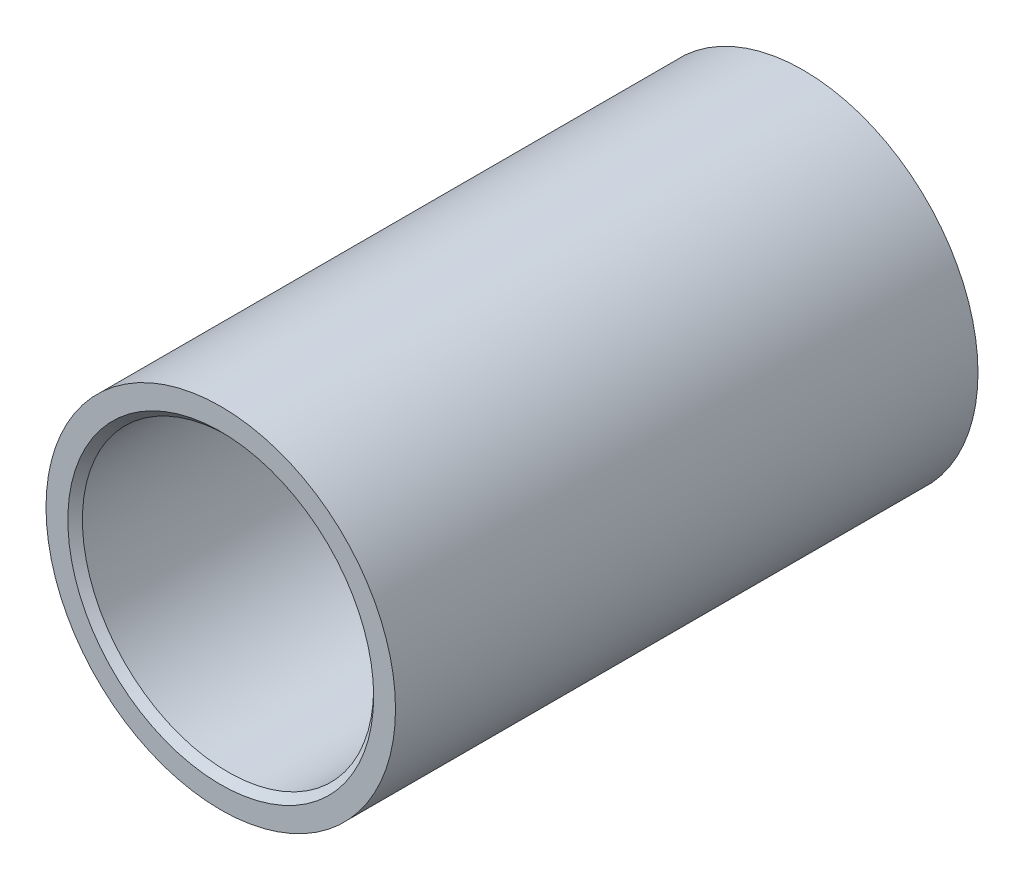
ISO-10303-21;
HEADER;
FILE_DESCRIPTION(('STEP AP214'),'2;1');
FILE_NAME('part.step','',(''),(''),'','','');
FILE_SCHEMA(('AUTOMOTIVE_DESIGN { 1 0 10303 214 1 1 1 1 }'));
ENDSEC;
DATA;
#1=APPLICATION_CONTEXT('core data for automotive mechanical design processes');
#2=APPLICATION_PROTOCOL_DEFINITION('international standard','automotive_design',2000,#1);
#3=PRODUCT_CONTEXT('',#1,'mechanical');
#4=PRODUCT('Part','Part','',(#3));
#5=PRODUCT_RELATED_PRODUCT_CATEGORY('part','',(#4));
#6=PRODUCT_DEFINITION_FORMATION('','',#4);
#7=PRODUCT_DEFINITION_CONTEXT('part definition',#1,'design');
#8=PRODUCT_DEFINITION('design','',#6,#7);
#9=PRODUCT_DEFINITION_SHAPE('','',#8);
#10=(LENGTH_UNIT() NAMED_UNIT(*) SI_UNIT(.MILLI.,.METRE.));
#11=(NAMED_UNIT(*) PLANE_ANGLE_UNIT() SI_UNIT($,.RADIAN.));
#12=(NAMED_UNIT(*) SI_UNIT($,.STERADIAN.) SOLID_ANGLE_UNIT());
#13=UNCERTAINTY_MEASURE_WITH_UNIT(LENGTH_MEASURE(1.E-05),#10,'distance_accuracy_value','');
#14=(GEOMETRIC_REPRESENTATION_CONTEXT(3) GLOBAL_UNCERTAINTY_ASSIGNED_CONTEXT((#13)) GLOBAL_UNIT_ASSIGNED_CONTEXT((#10,
#11,#12)) REPRESENTATION_CONTEXT('',''));
#15=CARTESIAN_POINT('',(0.,0.,0.));
#16=DIRECTION('',(0.,0.,1.));
#17=DIRECTION('',(1.,0.,0.));
#18=AXIS2_PLACEMENT_3D('',#15,#16,#17);
#19=CARTESIAN_POINT('',(0.,0.,31.75));
#20=DIRECTION('',(0.,0.,-1.));
#21=DIRECTION('',(-1.,0.,0.));
#22=AXIS2_PLACEMENT_3D('',#19,#20,#21);
#23=CYLINDRICAL_SURFACE('',#22,13.49375);
#24=CARTESIAN_POINT('',(0.,0.,4.7625));
#25=DIRECTION('',(0.,0.,1.));
#26=DIRECTION('',(1.,0.,0.));
#27=AXIS2_PLACEMENT_3D('',#24,#25,#26);
#28=CIRCLE('',#27,13.49375);
#29=CARTESIAN_POINT('',(13.49375,0.,4.7625));
#30=VERTEX_POINT('',#29);
#31=EDGE_CURVE('E71',#30,#30,#28,.T.);
#32=ORIENTED_EDGE('',*,*,#31,.T.);
#33=EDGE_LOOP('',(#32));
#34=FACE_BOUND('',#33,.T.);
#35=CARTESIAN_POINT('',(0.,0.,-4.7625));
#36=DIRECTION('',(0.,0.,1.));
#37=DIRECTION('',(1.,0.,0.));
#38=AXIS2_PLACEMENT_3D('',#35,#36,#37);
#39=CIRCLE('',#38,13.49375);
#40=CARTESIAN_POINT('',(13.49375,0.,-4.7625));
#41=VERTEX_POINT('',#40);
#42=EDGE_CURVE('E83',#41,#41,#39,.T.);
#43=ORIENTED_EDGE('',*,*,#42,.F.);
#44=EDGE_LOOP('',(#43));
#45=FACE_BOUND('',#44,.T.);
#46=ADVANCED_FACE('F45',(#34,#45),#23,.F.);
#47=CARTESIAN_POINT('',(0.,0.,31.75));
#48=DIRECTION('',(0.,0.,1.));
#49=DIRECTION('',(1.,0.,0.));
#50=AXIS2_PLACEMENT_3D('',#47,#48,#49);
#51=PLANE('',#50);
#52=CARTESIAN_POINT('',(0.,0.,31.75));
#53=DIRECTION('',(0.,0.,1.));
#54=DIRECTION('',(1.,0.,0.));
#55=AXIS2_PLACEMENT_3D('',#52,#53,#54);
#56=CIRCLE('',#55,16.66875);
#57=CARTESIAN_POINT('',(16.66875,0.,31.75));
#58=VERTEX_POINT('',#57);
#59=EDGE_CURVE('E10',#58,#58,#56,.F.);
#60=ORIENTED_EDGE('',*,*,#59,.T.);
#61=EDGE_LOOP('',(#60));
#62=FACE_BOUND('',#61,.T.);
#63=CARTESIAN_POINT('',(0.,0.,31.75));
#64=DIRECTION('',(0.,0.,1.));
#65=DIRECTION('',(1.,0.,0.));
#66=AXIS2_PLACEMENT_3D('',#63,#64,#65);
#67=CIRCLE('',#66,19.05);
#68=CARTESIAN_POINT('',(19.05,0.,31.75));
#69=VERTEX_POINT('',#68);
#70=EDGE_CURVE('E70',#69,#69,#67,.T.);
#71=ORIENTED_EDGE('',*,*,#70,.T.);
#72=EDGE_LOOP('',(#71));
#73=FACE_BOUND('',#72,.T.);
#74=ADVANCED_FACE('F113',(#62,#73),#51,.T.);
#75=CARTESIAN_POINT('',(0.,0.,31.75));
#76=DIRECTION('',(0.,0.,-1.));
#77=DIRECTION('',(-1.,0.,0.));
#78=AXIS2_PLACEMENT_3D('',#75,#76,#77);
#79=CYLINDRICAL_SURFACE('',#78,19.05);
#80=ORIENTED_EDGE('',*,*,#70,.F.);
#81=EDGE_LOOP('',(#80));
#82=FACE_BOUND('',#81,.T.);
#83=CARTESIAN_POINT('',(0.,0.,-31.75));
#84=DIRECTION('',(0.,0.,1.));
#85=DIRECTION('',(1.,0.,0.));
#86=AXIS2_PLACEMENT_3D('',#83,#84,#85);
#87=CIRCLE('',#86,19.05);
#88=CARTESIAN_POINT('',(19.05,0.,-31.75));
#89=VERTEX_POINT('',#88);
#90=EDGE_CURVE('E82',#89,#89,#87,.T.);
#91=ORIENTED_EDGE('',*,*,#90,.T.);
#92=EDGE_LOOP('',(#91));
#93=FACE_BOUND('',#92,.T.);
#94=ADVANCED_FACE('F119',(#82,#93),#79,.T.);
#95=CARTESIAN_POINT('',(0.,0.,4.7625));
#96=DIRECTION('',(0.,0.,1.));
#97=DIRECTION('',(1.,0.,0.));
#98=AXIS2_PLACEMENT_3D('',#95,#96,#97);
#99=CYLINDRICAL_SURFACE('',#98,15.875);
#100=CARTESIAN_POINT('',(0.,0.,30.95625));
#101=DIRECTION('',(0.,0.,1.));
#102=DIRECTION('',(1.,0.,0.));
#103=AXIS2_PLACEMENT_3D('',#100,#101,#102);
#104=CIRCLE('',#103,15.875);
#105=CARTESIAN_POINT('',(15.875,0.,30.95625));
#106=VERTEX_POINT('',#105);
#107=EDGE_CURVE('E54',#106,#106,#104,.T.);
#108=ORIENTED_EDGE('',*,*,#107,.T.);
#109=EDGE_LOOP('',(#108));
#110=FACE_BOUND('',#109,.T.);
#111=CARTESIAN_POINT('',(0.,0.,4.7625));
#112=DIRECTION('',(0.,0.,1.));
#113=DIRECTION('',(1.,0.,0.));
#114=AXIS2_PLACEMENT_3D('',#111,#112,#113);
#115=CIRCLE('',#114,15.875);
#116=CARTESIAN_POINT('',(15.875,0.,4.7625));
#117=VERTEX_POINT('',#116);
#118=EDGE_CURVE('E75',#117,#117,#115,.T.);
#119=ORIENTED_EDGE('',*,*,#118,.F.);
#120=EDGE_LOOP('',(#119));
#121=FACE_BOUND('',#120,.T.);
#122=ADVANCED_FACE('F123',(#110,#121),#99,.F.);
#123=CARTESIAN_POINT('',(0.,0.,4.7625));
#124=DIRECTION('',(0.,0.,1.));
#125=DIRECTION('',(1.,0.,0.));
#126=AXIS2_PLACEMENT_3D('',#123,#124,#125);
#127=PLANE('',#126);
#128=ORIENTED_EDGE('',*,*,#31,.F.);
#129=EDGE_LOOP('',(#128));
#130=FACE_BOUND('',#129,.T.);
#131=ORIENTED_EDGE('',*,*,#118,.T.);
#132=EDGE_LOOP('',(#131));
#133=FACE_BOUND('',#132,.T.);
#134=ADVANCED_FACE('F135',(#130,#133),#127,.T.);
#135=CARTESIAN_POINT('',(0.,0.,-31.75));
#136=DIRECTION('',(0.,0.,-1.));
#137=DIRECTION('',(1.,0.,0.));
#138=AXIS2_PLACEMENT_3D('',#135,#136,#137);
#139=PLANE('',#138);
#140=CARTESIAN_POINT('',(0.,0.,-31.75));
#141=DIRECTION('',(0.,0.,-1.));
#142=DIRECTION('',(-1.,0.,0.));
#143=AXIS2_PLACEMENT_3D('',#140,#141,#142);
#144=CIRCLE('',#143,16.66875);
#145=CARTESIAN_POINT('',(-16.66875,0.,-31.75));
#146=VERTEX_POINT('',#145);
#147=EDGE_CURVE('E64',#146,#146,#144,.F.);
#148=ORIENTED_EDGE('',*,*,#147,.T.);
#149=EDGE_LOOP('',(#148));
#150=FACE_BOUND('',#149,.T.);
#151=ORIENTED_EDGE('',*,*,#90,.F.);
#152=EDGE_LOOP('',(#151));
#153=FACE_BOUND('',#152,.T.);
#154=ADVANCED_FACE('F109',(#150,#153),#139,.T.);
#155=CARTESIAN_POINT('',(0.,0.,-4.7625));
#156=DIRECTION('',(0.,0.,-1.));
#157=DIRECTION('',(1.,0.,0.));
#158=AXIS2_PLACEMENT_3D('',#155,#156,#157);
#159=CYLINDRICAL_SURFACE('',#158,15.875);
#160=CARTESIAN_POINT('',(0.,0.,-30.95625));
#161=DIRECTION('',(0.,0.,-1.));
#162=DIRECTION('',(-1.,0.,0.));
#163=AXIS2_PLACEMENT_3D('',#160,#161,#162);
#164=CIRCLE('',#163,15.875);
#165=CARTESIAN_POINT('',(-15.875,0.,-30.95625));
#166=VERTEX_POINT('',#165);
#167=EDGE_CURVE('E59',#166,#166,#164,.T.);
#168=ORIENTED_EDGE('',*,*,#167,.T.);
#169=EDGE_LOOP('',(#168));
#170=FACE_BOUND('',#169,.T.);
#171=CARTESIAN_POINT('',(0.,0.,-4.7625));
#172=DIRECTION('',(0.,0.,1.));
#173=DIRECTION('',(1.,0.,0.));
#174=AXIS2_PLACEMENT_3D('',#171,#172,#173);
#175=CIRCLE('',#174,15.875);
#176=CARTESIAN_POINT('',(15.875,0.,-4.7625));
#177=VERTEX_POINT('',#176);
#178=EDGE_CURVE('E87',#177,#177,#175,.T.);
#179=ORIENTED_EDGE('',*,*,#178,.T.);
#180=EDGE_LOOP('',(#179));
#181=FACE_BOUND('',#180,.T.);
#182=ADVANCED_FACE('F95',(#170,#181),#159,.F.);
#183=CARTESIAN_POINT('',(0.,0.,-4.7625));
#184=DIRECTION('',(0.,0.,-1.));
#185=DIRECTION('',(1.,0.,0.));
#186=AXIS2_PLACEMENT_3D('',#183,#184,#185);
#187=PLANE('',#186);
#188=ORIENTED_EDGE('',*,*,#42,.T.);
#189=EDGE_LOOP('',(#188));
#190=FACE_BOUND('',#189,.T.);
#191=ORIENTED_EDGE('',*,*,#178,.F.);
#192=EDGE_LOOP('',(#191));
#193=FACE_BOUND('',#192,.T.);
#194=ADVANCED_FACE('F97',(#190,#193),#187,.T.);
#195=CARTESIAN_POINT('',(0.,0.,-31.75));
#196=DIRECTION('',(0.,0.,-1.));
#197=DIRECTION('',(-1.,0.,0.));
#198=AXIS2_PLACEMENT_3D('',#195,#196,#197);
#199=CONICAL_SURFACE('',#198,16.66875,0.785398163397444);
#200=ORIENTED_EDGE('',*,*,#167,.F.);
#201=EDGE_LOOP('',(#200));
#202=FACE_BOUND('',#201,.T.);
#203=ORIENTED_EDGE('',*,*,#147,.F.);
#204=EDGE_LOOP('',(#203));
#205=FACE_BOUND('',#204,.T.);
#206=ADVANCED_FACE('F99',(#202,#205),#199,.F.);
#207=CARTESIAN_POINT('',(0.,0.,30.95625));
#208=DIRECTION('',(0.,0.,1.));
#209=DIRECTION('',(1.,0.,0.));
#210=AXIS2_PLACEMENT_3D('',#207,#208,#209);
#211=CONICAL_SURFACE('',#210,15.875,0.785398163397444);
#212=ORIENTED_EDGE('',*,*,#59,.F.);
#213=EDGE_LOOP('',(#212));
#214=FACE_BOUND('',#213,.T.);
#215=ORIENTED_EDGE('',*,*,#107,.F.);
#216=EDGE_LOOP('',(#215));
#217=FACE_BOUND('',#216,.T.);
#218=ADVANCED_FACE('F48',(#214,#217),#211,.F.);
#219=CLOSED_SHELL('',(#46,#74,#94,#122,#134,#154,#182,#194,#206,#218));
#220=MANIFOLD_SOLID_BREP('B2',#219);
#221=ADVANCED_BREP_SHAPE_REPRESENTATION('',(#18,#220),#14);
#222=SHAPE_DEFINITION_REPRESENTATION(#9,#221);
ENDSEC;
END-ISO-10303-21;
